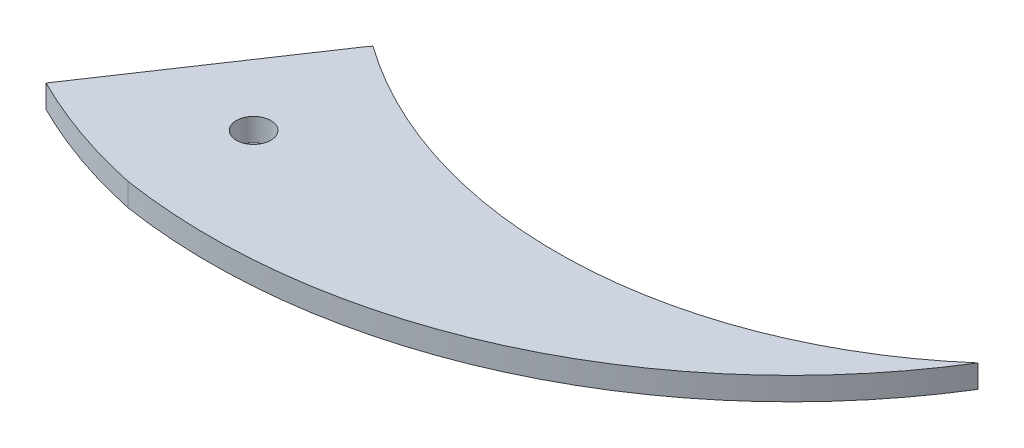
ISO-10303-21;
HEADER;
FILE_DESCRIPTION(('STEP AP214'),'2;1');
FILE_NAME('part.step','',(''),(''),'','','');
FILE_SCHEMA(('AUTOMOTIVE_DESIGN { 1 0 10303 214 1 1 1 1 }'));
ENDSEC;
DATA;
#1=APPLICATION_CONTEXT('core data for automotive mechanical design processes');
#2=APPLICATION_PROTOCOL_DEFINITION('international standard','automotive_design',2000,#1);
#3=PRODUCT_CONTEXT('',#1,'mechanical');
#4=PRODUCT('Part','Part','',(#3));
#5=PRODUCT_RELATED_PRODUCT_CATEGORY('part','',(#4));
#6=PRODUCT_DEFINITION_FORMATION('','',#4);
#7=PRODUCT_DEFINITION_CONTEXT('part definition',#1,'design');
#8=PRODUCT_DEFINITION('design','',#6,#7);
#9=PRODUCT_DEFINITION_SHAPE('','',#8);
#10=(LENGTH_UNIT() NAMED_UNIT(*) SI_UNIT(.MILLI.,.METRE.));
#11=(NAMED_UNIT(*) PLANE_ANGLE_UNIT() SI_UNIT($,.RADIAN.));
#12=(NAMED_UNIT(*) SI_UNIT($,.STERADIAN.) SOLID_ANGLE_UNIT());
#13=UNCERTAINTY_MEASURE_WITH_UNIT(LENGTH_MEASURE(1.E-05),#10,'distance_accuracy_value','');
#14=(GEOMETRIC_REPRESENTATION_CONTEXT(3) GLOBAL_UNCERTAINTY_ASSIGNED_CONTEXT((#13)) GLOBAL_UNIT_ASSIGNED_CONTEXT((#10,
#11,#12)) REPRESENTATION_CONTEXT('',''));
#15=CARTESIAN_POINT('',(0.,0.,0.));
#16=DIRECTION('',(0.,0.,1.));
#17=DIRECTION('',(1.,0.,0.));
#18=AXIS2_PLACEMENT_3D('',#15,#16,#17);
#19=CARTESIAN_POINT('',(-8.91214183515742,1.,-8.07068492741717));
#20=DIRECTION('',(0.,-1.,0.));
#21=DIRECTION('',(0.,0.,-1.));
#22=AXIS2_PLACEMENT_3D('',#19,#20,#21);
#23=CYLINDRICAL_SURFACE('',#22,23.1631945948204);
#24=CARTESIAN_POINT('',(-8.91214183515742,0.,-8.07068492741717));
#25=DIRECTION('',(0.,1.,0.));
#26=DIRECTION('',(0.,0.,1.));
#27=AXIS2_PLACEMENT_3D('',#24,#25,#26);
#28=CIRCLE('',#27,23.1631945948204);
#29=CARTESIAN_POINT('',(-19.2537092093889,0.,12.6557611760939));
#30=VERTEX_POINT('',#29);
#31=CARTESIAN_POINT('',(-13.765160624751,0.,14.5784164336826));
#32=VERTEX_POINT('',#31);
#33=EDGE_CURVE('E119',#30,#32,#28,.T.);
#34=ORIENTED_EDGE('',*,*,#33,.T.);
#35=DIRECTION('',(0.,-1.,0.));
#36=VECTOR('',#35,1.);
#37=CARTESIAN_POINT('',(-13.765160624751,1.,14.5784164336826));
#38=LINE('',#37,#36);
#39=CARTESIAN_POINT('',(-13.765160624751,1.,14.5784164336826));
#40=VERTEX_POINT('',#39);
#41=EDGE_CURVE('E11',#40,#32,#38,.T.);
#42=ORIENTED_EDGE('',*,*,#41,.F.);
#43=CARTESIAN_POINT('',(-8.91214183515742,1.,-8.07068492741717));
#44=DIRECTION('',(0.,1.,0.));
#45=DIRECTION('',(0.,0.,1.));
#46=AXIS2_PLACEMENT_3D('',#43,#44,#45);
#47=CIRCLE('',#46,23.1631945948204);
#48=CARTESIAN_POINT('',(-19.2537092093889,1.,12.6557611760939));
#49=VERTEX_POINT('',#48);
#50=EDGE_CURVE('E132',#49,#40,#47,.T.);
#51=ORIENTED_EDGE('',*,*,#50,.F.);
#52=DIRECTION('',(0.,-1.,0.));
#53=VECTOR('',#52,1.);
#54=CARTESIAN_POINT('',(-19.2537092093889,1.,12.6557611760939));
#55=LINE('',#54,#53);
#56=EDGE_CURVE('E115',#49,#30,#55,.T.);
#57=ORIENTED_EDGE('',*,*,#56,.T.);
#58=EDGE_LOOP('',(#34,#42,#51,#57));
#59=FACE_BOUND('',#58,.T.);
#60=ADVANCED_FACE('F39',(#59),#23,.T.);
#61=CARTESIAN_POINT('',(-9.88208800290413,1.,-10.4460456142252));
#62=DIRECTION('',(0.,-1.,0.));
#63=DIRECTION('',(0.,0.,-1.));
#64=AXIS2_PLACEMENT_3D('',#61,#62,#63);
#65=CYLINDRICAL_SURFACE('',#64,25.3239403287425);
#66=CARTESIAN_POINT('',(-9.88208800290413,0.,-10.4460456142252));
#67=DIRECTION('',(0.,1.,0.));
#68=DIRECTION('',(0.,0.,-1.));
#69=AXIS2_PLACEMENT_3D('',#66,#67,#68);
#70=CIRCLE('',#69,25.3239403287425);
#71=CARTESIAN_POINT('',(11.6363461598828,0.,2.90531929560764));
#72=VERTEX_POINT('',#71);
#73=EDGE_CURVE('E123',#32,#72,#70,.T.);
#74=ORIENTED_EDGE('',*,*,#73,.T.);
#75=DIRECTION('',(0.,-1.,0.));
#76=VECTOR('',#75,1.);
#77=CARTESIAN_POINT('',(11.6363461598828,1.,2.90531929560764));
#78=LINE('',#77,#76);
#79=CARTESIAN_POINT('',(11.6363461598828,1.,2.90531929560764));
#80=VERTEX_POINT('',#79);
#81=EDGE_CURVE('E49',#80,#72,#78,.T.);
#82=ORIENTED_EDGE('',*,*,#81,.F.);
#83=CARTESIAN_POINT('',(-9.88208800290413,1.,-10.4460456142252));
#84=DIRECTION('',(0.,1.,0.));
#85=DIRECTION('',(0.,0.,-1.));
#86=AXIS2_PLACEMENT_3D('',#83,#84,#85);
#87=CIRCLE('',#86,25.3239403287425);
#88=EDGE_CURVE('E91',#40,#80,#87,.T.);
#89=ORIENTED_EDGE('',*,*,#88,.F.);
#90=ORIENTED_EDGE('',*,*,#41,.T.);
#91=EDGE_LOOP('',(#74,#82,#89,#90));
#92=FACE_BOUND('',#91,.T.);
#93=ADVANCED_FACE('F156',(#92),#65,.T.);
#94=CARTESIAN_POINT('',(-1.71818195351361,1.,-12.3884355829255));
#95=DIRECTION('',(0.,-1.,0.));
#96=DIRECTION('',(0.,0.,-1.));
#97=AXIS2_PLACEMENT_3D('',#94,#95,#96);
#98=CYLINDRICAL_SURFACE('',#97,20.3037523481782);
#99=CARTESIAN_POINT('',(-1.71818195351361,0.,-12.3884355829255));
#100=DIRECTION('',(0.,-1.,0.));
#101=DIRECTION('',(0.,0.,1.));
#102=AXIS2_PLACEMENT_3D('',#99,#100,#101);
#103=CIRCLE('',#102,20.3037523481782);
#104=CARTESIAN_POINT('',(-13.518155162044,0.,4.13436659146725));
#105=VERTEX_POINT('',#104);
#106=EDGE_CURVE('E107',#72,#105,#103,.T.);
#107=ORIENTED_EDGE('',*,*,#106,.T.);
#108=DIRECTION('',(0.,-1.,0.));
#109=VECTOR('',#108,1.);
#110=CARTESIAN_POINT('',(-13.518155162044,1.,4.13436659146725));
#111=LINE('',#110,#109);
#112=CARTESIAN_POINT('',(-13.518155162044,1.,4.13436659146725));
#113=VERTEX_POINT('',#112);
#114=EDGE_CURVE('E104',#113,#105,#111,.T.);
#115=ORIENTED_EDGE('',*,*,#114,.F.);
#116=CARTESIAN_POINT('',(-1.71818195351361,1.,-12.3884355829255));
#117=DIRECTION('',(0.,-1.,0.));
#118=DIRECTION('',(0.,0.,1.));
#119=AXIS2_PLACEMENT_3D('',#116,#117,#118);
#120=CIRCLE('',#119,20.3037523481782);
#121=EDGE_CURVE('E95',#80,#113,#120,.T.);
#122=ORIENTED_EDGE('',*,*,#121,.F.);
#123=ORIENTED_EDGE('',*,*,#81,.T.);
#124=EDGE_LOOP('',(#107,#115,#122,#123));
#125=FACE_BOUND('',#124,.T.);
#126=ADVANCED_FACE('F105',(#125),#98,.F.);
#127=CARTESIAN_POINT('',(-22.9252067436591,1.,-2.80142165660711));
#128=DIRECTION('',(0.,-1.,0.));
#129=DIRECTION('',(0.,0.,-1.));
#130=AXIS2_PLACEMENT_3D('',#127,#128,#129);
#131=CYLINDRICAL_SURFACE('',#130,11.6875052120328);
#132=CARTESIAN_POINT('',(-22.9252067436591,0.,-2.80142165660711));
#133=DIRECTION('',(0.,-1.,0.));
#134=DIRECTION('',(0.,0.,1.));
#135=AXIS2_PLACEMENT_3D('',#132,#133,#134);
#136=CIRCLE('',#135,11.6875052120328);
#137=CARTESIAN_POINT('',(-13.6822644540969,0.,4.35160538885526));
#138=VERTEX_POINT('',#137);
#139=EDGE_CURVE('E77',#105,#138,#136,.T.);
#140=ORIENTED_EDGE('',*,*,#139,.T.);
#141=DIRECTION('',(0.,-1.,0.));
#142=VECTOR('',#141,1.);
#143=CARTESIAN_POINT('',(-13.6822644540969,1.,4.35160538885526));
#144=LINE('',#143,#142);
#145=CARTESIAN_POINT('',(-13.6822644540969,1.,4.35160538885526));
#146=VERTEX_POINT('',#145);
#147=EDGE_CURVE('E109',#146,#138,#144,.T.);
#148=ORIENTED_EDGE('',*,*,#147,.F.);
#149=CARTESIAN_POINT('',(-22.9252067436591,1.,-2.80142165660711));
#150=DIRECTION('',(0.,-1.,0.));
#151=DIRECTION('',(0.,0.,1.));
#152=AXIS2_PLACEMENT_3D('',#149,#150,#151);
#153=CIRCLE('',#152,11.6875052120328);
#154=EDGE_CURVE('E99',#113,#146,#153,.T.);
#155=ORIENTED_EDGE('',*,*,#154,.F.);
#156=ORIENTED_EDGE('',*,*,#114,.T.);
#157=EDGE_LOOP('',(#140,#148,#155,#156));
#158=FACE_BOUND('',#157,.T.);
#159=ADVANCED_FACE('F111',(#158),#131,.F.);
#160=CARTESIAN_POINT('',(-19.2537092093889,1.,12.6557611760939));
#161=DIRECTION('',(0.830415578723867,0.,0.557144475529198));
#162=DIRECTION('',(0.557144475529198,0.,-0.830415578723867));
#163=AXIS2_PLACEMENT_3D('',#160,#161,#162);
#164=PLANE('',#163);
#165=DIRECTION('',(-0.557144475529198,0.,0.830415578723867));
#166=VECTOR('',#165,1.);
#167=CARTESIAN_POINT('',(-19.2537092093889,0.,12.6557611760939));
#168=LINE('',#167,#166);
#169=EDGE_CURVE('E83',#138,#30,#168,.T.);
#170=ORIENTED_EDGE('',*,*,#169,.T.);
#171=ORIENTED_EDGE('',*,*,#56,.F.);
#172=DIRECTION('',(-0.557144475529198,0.,0.830415578723867));
#173=VECTOR('',#172,1.);
#174=CARTESIAN_POINT('',(-19.2537092093889,1.,12.6557611760939));
#175=LINE('',#174,#173);
#176=EDGE_CURVE('E57',#146,#49,#175,.T.);
#177=ORIENTED_EDGE('',*,*,#176,.F.);
#178=ORIENTED_EDGE('',*,*,#147,.T.);
#179=EDGE_LOOP('',(#170,#171,#177,#178));
#180=FACE_BOUND('',#179,.T.);
#181=ADVANCED_FACE('F144',(#180),#164,.F.);
#182=CARTESIAN_POINT('',(-8.91214183515742,1.,-8.07068492741717));
#183=DIRECTION('',(0.,1.,0.));
#184=DIRECTION('',(0.,0.,1.));
#185=AXIS2_PLACEMENT_3D('',#182,#183,#184);
#186=PLANE('',#185);
#187=CARTESIAN_POINT('',(-12.9374270191447,1.,9.91990977380041));
#188=DIRECTION('',(0.,1.,0.));
#189=DIRECTION('',(0.,0.,1.));
#190=AXIS2_PLACEMENT_3D('',#187,#188,#189);
#191=CIRCLE('',#190,0.75);
#192=CARTESIAN_POINT('',(-12.9374270191447,1.,10.6699097738004));
#193=VERTEX_POINT('',#192);
#194=EDGE_CURVE('E205',#193,#193,#191,.T.);
#195=ORIENTED_EDGE('',*,*,#194,.F.);
#196=EDGE_LOOP('',(#195));
#197=FACE_BOUND('',#196,.T.);
#198=ORIENTED_EDGE('',*,*,#50,.T.);
#199=ORIENTED_EDGE('',*,*,#88,.T.);
#200=ORIENTED_EDGE('',*,*,#121,.T.);
#201=ORIENTED_EDGE('',*,*,#154,.T.);
#202=ORIENTED_EDGE('',*,*,#176,.T.);
#203=EDGE_LOOP('',(#198,#199,#200,#201,#202));
#204=FACE_BOUND('',#203,.T.);
#205=ADVANCED_FACE('F97',(#197,#204),#186,.T.);
#206=CARTESIAN_POINT('',(-8.91214183515742,0.,-8.07068492741717));
#207=DIRECTION('',(0.,1.,0.));
#208=DIRECTION('',(0.,0.,1.));
#209=AXIS2_PLACEMENT_3D('',#206,#207,#208);
#210=PLANE('',#209);
#211=CARTESIAN_POINT('',(-12.9374270191447,0.,9.91990977380041));
#212=DIRECTION('',(0.,1.,0.));
#213=DIRECTION('',(0.,0.,1.));
#214=AXIS2_PLACEMENT_3D('',#211,#212,#213);
#215=CIRCLE('',#214,0.75);
#216=CARTESIAN_POINT('',(-12.9374270191447,0.,10.6699097738004));
#217=VERTEX_POINT('',#216);
#218=EDGE_CURVE('E42',#217,#217,#215,.T.);
#219=ORIENTED_EDGE('',*,*,#218,.T.);
#220=EDGE_LOOP('',(#219));
#221=FACE_BOUND('',#220,.T.);
#222=ORIENTED_EDGE('',*,*,#33,.F.);
#223=ORIENTED_EDGE('',*,*,#169,.F.);
#224=ORIENTED_EDGE('',*,*,#139,.F.);
#225=ORIENTED_EDGE('',*,*,#106,.F.);
#226=ORIENTED_EDGE('',*,*,#73,.F.);
#227=EDGE_LOOP('',(#222,#223,#224,#225,#226));
#228=FACE_BOUND('',#227,.T.);
#229=ADVANCED_FACE('F140',(#221,#228),#210,.F.);
#230=CARTESIAN_POINT('',(-12.9374270191447,-9.,9.91990977380041));
#231=DIRECTION('',(0.,1.,0.));
#232=DIRECTION('',(0.,0.,1.));
#233=AXIS2_PLACEMENT_3D('',#230,#231,#232);
#234=CYLINDRICAL_SURFACE('',#233,0.75);
#235=ORIENTED_EDGE('',*,*,#194,.T.);
#236=EDGE_LOOP('',(#235));
#237=FACE_BOUND('',#236,.T.);
#238=ORIENTED_EDGE('',*,*,#218,.F.);
#239=EDGE_LOOP('',(#238));
#240=FACE_BOUND('',#239,.T.);
#241=ADVANCED_FACE('F189',(#237,#240),#234,.F.);
#242=CLOSED_SHELL('',(#60,#93,#126,#159,#181,#205,#229,#241));
#243=MANIFOLD_SOLID_BREP('B2',#242);
#244=ADVANCED_BREP_SHAPE_REPRESENTATION('',(#18,#243),#14);
#245=SHAPE_DEFINITION_REPRESENTATION(#9,#244);
ENDSEC;
END-ISO-10303-21;
